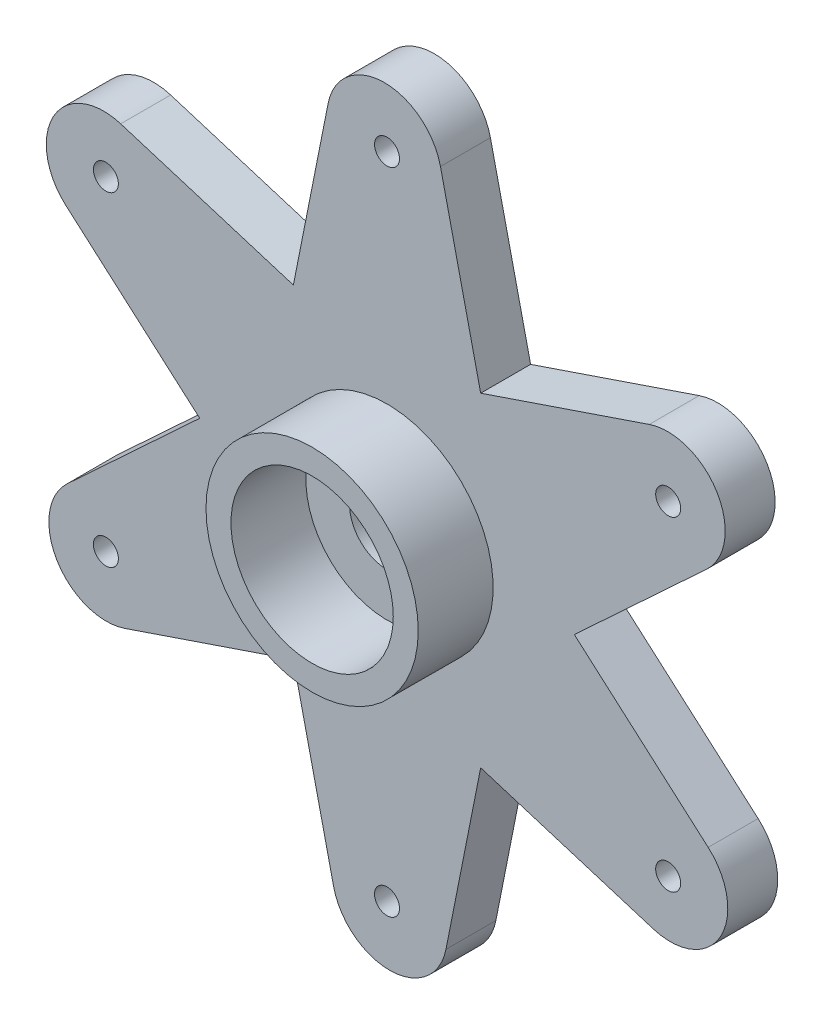
ISO-10303-21;
HEADER;
FILE_DESCRIPTION(('STEP AP214'),'2;1');
FILE_NAME('part.step','',(''),(''),'','','');
FILE_SCHEMA(('AUTOMOTIVE_DESIGN { 1 0 10303 214 1 1 1 1 }'));
ENDSEC;
DATA;
#1=APPLICATION_CONTEXT('core data for automotive mechanical design processes');
#2=APPLICATION_PROTOCOL_DEFINITION('international standard','automotive_design',2000,#1);
#3=PRODUCT_CONTEXT('',#1,'mechanical');
#4=PRODUCT('Part','Part','',(#3));
#5=PRODUCT_RELATED_PRODUCT_CATEGORY('part','',(#4));
#6=PRODUCT_DEFINITION_FORMATION('','',#4);
#7=PRODUCT_DEFINITION_CONTEXT('part definition',#1,'design');
#8=PRODUCT_DEFINITION('design','',#6,#7);
#9=PRODUCT_DEFINITION_SHAPE('','',#8);
#10=(LENGTH_UNIT() NAMED_UNIT(*) SI_UNIT(.MILLI.,.METRE.));
#11=(NAMED_UNIT(*) PLANE_ANGLE_UNIT() SI_UNIT($,.RADIAN.));
#12=(NAMED_UNIT(*) SI_UNIT($,.STERADIAN.) SOLID_ANGLE_UNIT());
#13=UNCERTAINTY_MEASURE_WITH_UNIT(LENGTH_MEASURE(1.E-05),#10,'distance_accuracy_value','');
#14=(GEOMETRIC_REPRESENTATION_CONTEXT(3) GLOBAL_UNCERTAINTY_ASSIGNED_CONTEXT((#13)) GLOBAL_UNIT_ASSIGNED_CONTEXT((#10,
#11,#12)) REPRESENTATION_CONTEXT('',''));
#15=CARTESIAN_POINT('',(0.,0.,0.));
#16=DIRECTION('',(0.,0.,1.));
#17=DIRECTION('',(1.,0.,0.));
#18=AXIS2_PLACEMENT_3D('',#15,#16,#17);
#19=CARTESIAN_POINT('',(11.2409388994982,6.60897085183293,1.));
#20=DIRECTION('',(0.,0.,-1.));
#21=DIRECTION('',(-1.,0.,0.));
#22=AXIS2_PLACEMENT_3D('',#19,#20,#21);
#23=PLANE('',#22);
#24=CARTESIAN_POINT('',(0.,0.,1.));
#25=DIRECTION('',(0.,0.,1.));
#26=DIRECTION('',(1.,0.,0.));
#27=AXIS2_PLACEMENT_3D('',#24,#25,#26);
#28=CIRCLE('',#27,1.5);
#29=CARTESIAN_POINT('',(1.5,0.,1.));
#30=VERTEX_POINT('',#29);
#31=EDGE_CURVE('E202',#30,#30,#28,.T.);
#32=ORIENTED_EDGE('',*,*,#31,.F.);
#33=EDGE_LOOP('',(#32));
#34=FACE_BOUND('',#33,.T.);
#35=CARTESIAN_POINT('',(0.,0.,1.));
#36=DIRECTION('',(0.,0.,1.));
#37=DIRECTION('',(1.,0.,0.));
#38=AXIS2_PLACEMENT_3D('',#35,#36,#37);
#39=CIRCLE('',#38,3.25);
#40=CARTESIAN_POINT('',(3.25,0.,1.));
#41=VERTEX_POINT('',#40);
#42=EDGE_CURVE('E713',#41,#41,#39,.T.);
#43=ORIENTED_EDGE('',*,*,#42,.T.);
#44=EDGE_LOOP('',(#43));
#45=FACE_BOUND('',#44,.T.);
#46=ADVANCED_FACE('F40',(#34,#45),#23,.F.);
#47=CARTESIAN_POINT('',(0.,13.,1.));
#48=DIRECTION('',(0.,0.,1.));
#49=DIRECTION('',(1.,0.,0.));
#50=AXIS2_PLACEMENT_3D('',#47,#48,#49);
#51=CIRCLE('',#50,0.5);
#52=CARTESIAN_POINT('',(0.5,13.,1.));
#53=VERTEX_POINT('',#52);
#54=EDGE_CURVE('E710',#53,#53,#51,.T.);
#55=ORIENTED_EDGE('',*,*,#54,.F.);
#56=EDGE_LOOP('',(#55));
#57=FACE_BOUND('',#56,.T.);
#58=CARTESIAN_POINT('',(11.258330249198,6.50000000000048,1.));
#59=DIRECTION('',(0.,0.,1.));
#60=DIRECTION('',(1.,0.,0.));
#61=AXIS2_PLACEMENT_3D('',#58,#59,#60);
#62=CIRCLE('',#61,0.500000000000155);
#63=CARTESIAN_POINT('',(11.7583302491981,6.50000000000048,1.));
#64=VERTEX_POINT('',#63);
#65=EDGE_CURVE('E719',#64,#64,#62,.T.);
#66=ORIENTED_EDGE('',*,*,#65,.F.);
#67=EDGE_LOOP('',(#66));
#68=FACE_BOUND('',#67,.T.);
#69=CARTESIAN_POINT('',(11.2583302491985,-6.49999999999952,1.));
#70=DIRECTION('',(0.,0.,1.));
#71=DIRECTION('',(1.,0.,0.));
#72=AXIS2_PLACEMENT_3D('',#69,#70,#71);
#73=CIRCLE('',#72,0.500000000000712);
#74=CARTESIAN_POINT('',(11.7583302491992,-6.49999999999952,1.));
#75=VERTEX_POINT('',#74);
#76=EDGE_CURVE('E740',#75,#75,#73,.T.);
#77=ORIENTED_EDGE('',*,*,#76,.F.);
#78=EDGE_LOOP('',(#77));
#79=FACE_BOUND('',#78,.T.);
#80=CARTESIAN_POINT('',(1.10367054526908E-12,-13.,1.));
#81=DIRECTION('',(0.,0.,1.));
#82=DIRECTION('',(1.,0.,0.));
#83=AXIS2_PLACEMENT_3D('',#80,#81,#82);
#84=CIRCLE('',#83,0.500000000001142);
#85=CARTESIAN_POINT('',(0.500000000002246,-13.,1.));
#86=VERTEX_POINT('',#85);
#87=EDGE_CURVE('E734',#86,#86,#84,.T.);
#88=ORIENTED_EDGE('',*,*,#87,.F.);
#89=EDGE_LOOP('',(#88));
#90=FACE_BOUND('',#89,.T.);
#91=CARTESIAN_POINT('',(-11.2583302491969,-6.50000000000048,1.));
#92=DIRECTION('',(0.,0.,1.));
#93=DIRECTION('',(1.,0.,0.));
#94=AXIS2_PLACEMENT_3D('',#91,#92,#93);
#95=CIRCLE('',#94,0.500000000001051);
#96=CARTESIAN_POINT('',(-10.7583302491958,-6.50000000000048,1.));
#97=VERTEX_POINT('',#96);
#98=EDGE_CURVE('E728',#97,#97,#95,.T.);
#99=ORIENTED_EDGE('',*,*,#98,.F.);
#100=EDGE_LOOP('',(#99));
#101=FACE_BOUND('',#100,.T.);
#102=CARTESIAN_POINT('',(-11.2583302491974,6.49999999999952,1.));
#103=DIRECTION('',(0.,0.,1.));
#104=DIRECTION('',(1.,0.,0.));
#105=AXIS2_PLACEMENT_3D('',#102,#103,#104);
#106=CIRCLE('',#105,0.500000000000557);
#107=CARTESIAN_POINT('',(-10.7583302491969,6.49999999999952,1.));
#108=VERTEX_POINT('',#107);
#109=EDGE_CURVE('E711',#108,#108,#106,.T.);
#110=ORIENTED_EDGE('',*,*,#109,.F.);
#111=EDGE_LOOP('',(#110));
#112=FACE_BOUND('',#111,.T.);
#113=CARTESIAN_POINT('',(0.,0.,1.));
#114=DIRECTION('',(0.,0.,-1.));
#115=DIRECTION('',(-1.,0.,0.));
#116=AXIS2_PLACEMENT_3D('',#113,#114,#115);
#117=CIRCLE('',#116,4.25);
#118=CARTESIAN_POINT('',(-4.25,0.,1.));
#119=VERTEX_POINT('',#118);
#120=EDGE_CURVE('E11',#119,#119,#117,.F.);
#121=ORIENTED_EDGE('',*,*,#120,.F.);
#122=EDGE_LOOP('',(#121));
#123=FACE_BOUND('',#122,.T.);
#124=DIRECTION('',(-0.946895822393242,-0.321540513052749,0.));
#125=VECTOR('',#124,1.);
#126=CARTESIAN_POINT('',(3.75,6.49519052838329,1.));
#127=LINE('',#126,#125);
#128=CARTESIAN_POINT('',(10.5011056178941,8.78768555551781,1.));
#129=VERTEX_POINT('',#128);
#130=CARTESIAN_POINT('',(3.75,6.49519052838329,1.));
#131=VERTEX_POINT('',#130);
#132=EDGE_CURVE('E233',#129,#131,#127,.T.);
#133=ORIENTED_EDGE('',*,*,#132,.T.);
#134=DIRECTION('',(-0.222430892223186,0.974948459245307,0.));
#135=VECTOR('',#134,1.);
#136=CARTESIAN_POINT('',(3.75,6.49519052838329,1.));
#137=LINE('',#136,#135);
#138=CARTESIAN_POINT('',(2.14019387739905,13.5512158098835,1.));
#139=VERTEX_POINT('',#138);
#140=EDGE_CURVE('E131',#131,#139,#137,.T.);
#141=ORIENTED_EDGE('',*,*,#140,.T.);
#142=CARTESIAN_POINT('',(-0.103067200809109,13.0394240752706,1.));
#143=DIRECTION('',(0.,0.,1.));
#144=DIRECTION('',(-1.,0.,0.));
#145=AXIS2_PLACEMENT_3D('',#142,#143,#144);
#146=CIRCLE('',#145,2.30090222404642);
#147=CARTESIAN_POINT('',(-2.35980612260095,13.4880670106787,1.));
#148=VERTEX_POINT('',#147);
#149=EDGE_CURVE('E297',#139,#148,#146,.T.);
#150=ORIENTED_EDGE('',*,*,#149,.T.);
#151=DIRECTION('',(-0.194985658547059,-0.98080609345628,0.));
#152=VECTOR('',#151,1.);
#153=CARTESIAN_POINT('',(-3.75,6.49519052838329,1.));
#154=LINE('',#153,#152);
#155=CARTESIAN_POINT('',(-3.75,6.49519052838329,1.));
#156=VERTEX_POINT('',#155);
#157=EDGE_CURVE('E294',#148,#156,#154,.T.);
#158=ORIENTED_EDGE('',*,*,#157,.T.);
#159=DIRECTION('',(-0.955545579198526,0.294843426370934,0.));
#160=VECTOR('',#159,1.);
#161=CARTESIAN_POINT('',(-3.75,6.49519052838329,1.));
#162=LINE('',#161,#160);
#163=CARTESIAN_POINT('',(-10.6656002048249,8.62907017179326,1.));
#164=VERTEX_POINT('',#163);
#165=EDGE_CURVE('E296',#156,#164,#162,.T.);
#166=ORIENTED_EDGE('',*,*,#165,.T.);
#167=CARTESIAN_POINT('',(-11.3440061003073,6.43045322343764,1.));
#168=DIRECTION('',(0.,0.,1.));
#169=DIRECTION('',(-1.,0.,0.));
#170=AXIS2_PLACEMENT_3D('',#167,#168,#169);
#171=CIRCLE('',#170,2.30090222404642);
#172=CARTESIAN_POINT('',(-12.860911740495,4.70038145516084,1.));
#173=VERTEX_POINT('',#172);
#174=EDGE_CURVE('E299',#164,#173,#171,.T.);
#175=ORIENTED_EDGE('',*,*,#174,.T.);
#176=DIRECTION('',(0.751910163846184,-0.659265580403531,0.));
#177=VECTOR('',#176,1.);
#178=CARTESIAN_POINT('',(-7.5,0.,1.));
#179=LINE('',#178,#177);
#180=CARTESIAN_POINT('',(-7.5,0.,1.));
#181=VERTEX_POINT('',#180);
#182=EDGE_CURVE('E305',#173,#181,#179,.T.);
#183=ORIENTED_EDGE('',*,*,#182,.T.);
#184=DIRECTION('',(-0.73311468697534,-0.680105032874371,0.));
#185=VECTOR('',#184,1.);
#186=CARTESIAN_POINT('',(-7.5,0.,1.));
#187=LINE('',#186,#185);
#188=CARTESIAN_POINT('',(-12.805794082224,-4.92214563809028,1.));
#189=VERTEX_POINT('',#188);
#190=EDGE_CURVE('E307',#181,#189,#187,.T.);
#191=ORIENTED_EDGE('',*,*,#190,.T.);
#192=CARTESIAN_POINT('',(-11.2409388994982,-6.60897085183294,1.));
#193=DIRECTION('',(0.,0.,1.));
#194=DIRECTION('',(-1.,0.,0.));
#195=AXIS2_PLACEMENT_3D('',#192,#193,#194);
#196=CIRCLE('',#195,2.30090222404643);
#197=CARTESIAN_POINT('',(-10.5011056178941,-8.78768555551782,1.));
#198=VERTEX_POINT('',#197);
#199=EDGE_CURVE('E309',#189,#198,#196,.T.);
#200=ORIENTED_EDGE('',*,*,#199,.T.);
#201=DIRECTION('',(0.946895822393242,0.32154051305275,0.));
#202=VECTOR('',#201,1.);
#203=CARTESIAN_POINT('',(-3.75,-6.4951905283833,1.));
#204=LINE('',#203,#202);
#205=CARTESIAN_POINT('',(-3.75,-6.4951905283833,1.));
#206=VERTEX_POINT('',#205);
#207=EDGE_CURVE('E311',#198,#206,#204,.T.);
#208=ORIENTED_EDGE('',*,*,#207,.T.);
#209=DIRECTION('',(0.222430892223186,-0.974948459245307,0.));
#210=VECTOR('',#209,1.);
#211=CARTESIAN_POINT('',(-3.75,-6.4951905283833,1.));
#212=LINE('',#211,#210);
#213=CARTESIAN_POINT('',(-2.14019387739905,-13.5512158098835,1.));
#214=VERTEX_POINT('',#213);
#215=EDGE_CURVE('E313',#206,#214,#212,.T.);
#216=ORIENTED_EDGE('',*,*,#215,.T.);
#217=CARTESIAN_POINT('',(0.103067200809111,-13.0394240752706,1.));
#218=DIRECTION('',(0.,0.,1.));
#219=DIRECTION('',(-1.,0.,0.));
#220=AXIS2_PLACEMENT_3D('',#217,#218,#219);
#221=CIRCLE('',#220,2.30090222404642);
#222=CARTESIAN_POINT('',(2.35980612260095,-13.4880670106787,1.));
#223=VERTEX_POINT('',#222);
#224=EDGE_CURVE('E315',#214,#223,#221,.T.);
#225=ORIENTED_EDGE('',*,*,#224,.T.);
#226=DIRECTION('',(0.194985658547059,0.98080609345628,0.));
#227=VECTOR('',#226,1.);
#228=CARTESIAN_POINT('',(3.75,-6.4951905283833,1.));
#229=LINE('',#228,#227);
#230=CARTESIAN_POINT('',(3.75,-6.4951905283833,1.));
#231=VERTEX_POINT('',#230);
#232=EDGE_CURVE('E317',#223,#231,#229,.T.);
#233=ORIENTED_EDGE('',*,*,#232,.T.);
#234=DIRECTION('',(0.955545579198526,-0.294843426370935,0.));
#235=VECTOR('',#234,1.);
#236=CARTESIAN_POINT('',(3.75,-6.4951905283833,1.));
#237=LINE('',#236,#235);
#238=CARTESIAN_POINT('',(10.6656002048249,-8.62907017179327,1.));
#239=VERTEX_POINT('',#238);
#240=EDGE_CURVE('E319',#231,#239,#237,.T.);
#241=ORIENTED_EDGE('',*,*,#240,.T.);
#242=CARTESIAN_POINT('',(11.3440061003073,-6.43045322343765,1.));
#243=DIRECTION('',(0.,0.,1.));
#244=DIRECTION('',(-1.,0.,0.));
#245=AXIS2_PLACEMENT_3D('',#242,#243,#244);
#246=CIRCLE('',#245,2.30090222404642);
#247=CARTESIAN_POINT('',(12.860911740495,-4.70038145516085,1.));
#248=VERTEX_POINT('',#247);
#249=EDGE_CURVE('E180',#239,#248,#246,.T.);
#250=ORIENTED_EDGE('',*,*,#249,.T.);
#251=DIRECTION('',(-0.751910163846184,0.659265580403531,0.));
#252=VECTOR('',#251,1.);
#253=CARTESIAN_POINT('',(7.5,0.,1.));
#254=LINE('',#253,#252);
#255=CARTESIAN_POINT('',(7.5,0.,1.));
#256=VERTEX_POINT('',#255);
#257=EDGE_CURVE('E174',#248,#256,#254,.T.);
#258=ORIENTED_EDGE('',*,*,#257,.T.);
#259=DIRECTION('',(0.73311468697534,0.680105032874371,0.));
#260=VECTOR('',#259,1.);
#261=CARTESIAN_POINT('',(7.5,0.,1.));
#262=LINE('',#261,#260);
#263=CARTESIAN_POINT('',(12.805794082224,4.92214563809027,1.));
#264=VERTEX_POINT('',#263);
#265=EDGE_CURVE('E178',#256,#264,#262,.T.);
#266=ORIENTED_EDGE('',*,*,#265,.T.);
#267=CARTESIAN_POINT('',(11.2409388994982,6.60897085183293,1.));
#268=DIRECTION('',(0.,0.,1.));
#269=DIRECTION('',(-1.,0.,0.));
#270=AXIS2_PLACEMENT_3D('',#267,#268,#269);
#271=CIRCLE('',#270,2.30090222404642);
#272=EDGE_CURVE('E57',#264,#129,#271,.T.);
#273=ORIENTED_EDGE('',*,*,#272,.T.);
#274=EDGE_LOOP('',(#133,#141,#150,#158,#166,#175,#183,#191,#200,#208,#216,#225,#233,#241,#250,
#258,#266,#273));
#275=FACE_BOUND('',#274,.T.);
#276=ADVANCED_FACE('F176',(#57,#68,#79,#90,#101,#112,#123,#275),#23,.F.);
#277=CARTESIAN_POINT('',(11.2409388994982,6.60897085183293,-1.));
#278=DIRECTION('',(0.,0.,-1.));
#279=DIRECTION('',(-1.,0.,0.));
#280=AXIS2_PLACEMENT_3D('',#277,#278,#279);
#281=PLANE('',#280);
#282=CARTESIAN_POINT('',(0.,13.,-1.));
#283=DIRECTION('',(0.,0.,1.));
#284=DIRECTION('',(1.,0.,0.));
#285=AXIS2_PLACEMENT_3D('',#282,#283,#284);
#286=CIRCLE('',#285,0.5);
#287=CARTESIAN_POINT('',(0.5,13.,-1.));
#288=VERTEX_POINT('',#287);
#289=EDGE_CURVE('E707',#288,#288,#286,.T.);
#290=ORIENTED_EDGE('',*,*,#289,.T.);
#291=EDGE_LOOP('',(#290));
#292=FACE_BOUND('',#291,.T.);
#293=CARTESIAN_POINT('',(11.258330249198,6.50000000000048,-1.));
#294=DIRECTION('',(0.,0.,1.));
#295=DIRECTION('',(1.,0.,0.));
#296=AXIS2_PLACEMENT_3D('',#293,#294,#295);
#297=CIRCLE('',#296,0.500000000000155);
#298=CARTESIAN_POINT('',(11.7583302491981,6.50000000000048,-1.));
#299=VERTEX_POINT('',#298);
#300=EDGE_CURVE('E723',#299,#299,#297,.T.);
#301=ORIENTED_EDGE('',*,*,#300,.T.);
#302=EDGE_LOOP('',(#301));
#303=FACE_BOUND('',#302,.T.);
#304=CARTESIAN_POINT('',(11.2583302491985,-6.49999999999952,-1.));
#305=DIRECTION('',(0.,0.,1.));
#306=DIRECTION('',(1.,0.,0.));
#307=AXIS2_PLACEMENT_3D('',#304,#305,#306);
#308=CIRCLE('',#307,0.500000000000712);
#309=CARTESIAN_POINT('',(11.7583302491992,-6.49999999999952,-1.));
#310=VERTEX_POINT('',#309);
#311=EDGE_CURVE('E722',#310,#310,#308,.T.);
#312=ORIENTED_EDGE('',*,*,#311,.T.);
#313=EDGE_LOOP('',(#312));
#314=FACE_BOUND('',#313,.T.);
#315=CARTESIAN_POINT('',(1.10367054526908E-12,-13.,-1.));
#316=DIRECTION('',(0.,0.,1.));
#317=DIRECTION('',(1.,0.,0.));
#318=AXIS2_PLACEMENT_3D('',#315,#316,#317);
#319=CIRCLE('',#318,0.500000000001142);
#320=CARTESIAN_POINT('',(0.500000000002246,-13.,-1.));
#321=VERTEX_POINT('',#320);
#322=EDGE_CURVE('E737',#321,#321,#319,.T.);
#323=ORIENTED_EDGE('',*,*,#322,.T.);
#324=EDGE_LOOP('',(#323));
#325=FACE_BOUND('',#324,.T.);
#326=CARTESIAN_POINT('',(-11.2583302491969,-6.50000000000048,-1.));
#327=DIRECTION('',(0.,0.,1.));
#328=DIRECTION('',(1.,0.,0.));
#329=AXIS2_PLACEMENT_3D('',#326,#327,#328);
#330=CIRCLE('',#329,0.500000000001051);
#331=CARTESIAN_POINT('',(-10.7583302491958,-6.50000000000048,-1.));
#332=VERTEX_POINT('',#331);
#333=EDGE_CURVE('E731',#332,#332,#330,.T.);
#334=ORIENTED_EDGE('',*,*,#333,.T.);
#335=EDGE_LOOP('',(#334));
#336=FACE_BOUND('',#335,.T.);
#337=CARTESIAN_POINT('',(-11.2583302491974,6.49999999999952,-1.));
#338=DIRECTION('',(0.,0.,1.));
#339=DIRECTION('',(1.,0.,0.));
#340=AXIS2_PLACEMENT_3D('',#337,#338,#339);
#341=CIRCLE('',#340,0.500000000000557);
#342=CARTESIAN_POINT('',(-10.7583302491969,6.49999999999952,-1.));
#343=VERTEX_POINT('',#342);
#344=EDGE_CURVE('E716',#343,#343,#341,.T.);
#345=ORIENTED_EDGE('',*,*,#344,.T.);
#346=EDGE_LOOP('',(#345));
#347=FACE_BOUND('',#346,.T.);
#348=DIRECTION('',(-0.946895822393242,-0.321540513052749,0.));
#349=VECTOR('',#348,1.);
#350=CARTESIAN_POINT('',(3.75,6.49519052838329,-1.));
#351=LINE('',#350,#349);
#352=CARTESIAN_POINT('',(10.5011056178941,8.78768555551781,-1.));
#353=VERTEX_POINT('',#352);
#354=CARTESIAN_POINT('',(3.75,6.49519052838329,-1.));
#355=VERTEX_POINT('',#354);
#356=EDGE_CURVE('E198',#353,#355,#351,.T.);
#357=ORIENTED_EDGE('',*,*,#356,.F.);
#358=CARTESIAN_POINT('',(11.2409388994982,6.60897085183293,-1.));
#359=DIRECTION('',(0.,0.,1.));
#360=DIRECTION('',(-1.,0.,0.));
#361=AXIS2_PLACEMENT_3D('',#358,#359,#360);
#362=CIRCLE('',#361,2.30090222404642);
#363=CARTESIAN_POINT('',(12.805794082224,4.92214563809027,-1.));
#364=VERTEX_POINT('',#363);
#365=EDGE_CURVE('E122',#364,#353,#362,.T.);
#366=ORIENTED_EDGE('',*,*,#365,.F.);
#367=DIRECTION('',(0.73311468697534,0.680105032874371,0.));
#368=VECTOR('',#367,1.);
#369=CARTESIAN_POINT('',(7.5,0.,-1.));
#370=LINE('',#369,#368);
#371=CARTESIAN_POINT('',(7.5,0.,-1.));
#372=VERTEX_POINT('',#371);
#373=EDGE_CURVE('E116',#372,#364,#370,.T.);
#374=ORIENTED_EDGE('',*,*,#373,.F.);
#375=DIRECTION('',(-0.751910163846184,0.659265580403531,0.));
#376=VECTOR('',#375,1.);
#377=CARTESIAN_POINT('',(7.5,0.,-1.));
#378=LINE('',#377,#376);
#379=CARTESIAN_POINT('',(12.860911740495,-4.70038145516085,-1.));
#380=VERTEX_POINT('',#379);
#381=EDGE_CURVE('E188',#380,#372,#378,.T.);
#382=ORIENTED_EDGE('',*,*,#381,.F.);
#383=CARTESIAN_POINT('',(11.3440061003073,-6.43045322343765,-1.));
#384=DIRECTION('',(0.,0.,1.));
#385=DIRECTION('',(-1.,0.,0.));
#386=AXIS2_PLACEMENT_3D('',#383,#384,#385);
#387=CIRCLE('',#386,2.30090222404642);
#388=CARTESIAN_POINT('',(10.6656002048249,-8.62907017179327,-1.));
#389=VERTEX_POINT('',#388);
#390=EDGE_CURVE('E228',#389,#380,#387,.T.);
#391=ORIENTED_EDGE('',*,*,#390,.F.);
#392=DIRECTION('',(0.955545579198526,-0.294843426370935,0.));
#393=VECTOR('',#392,1.);
#394=CARTESIAN_POINT('',(3.75,-6.4951905283833,-1.));
#395=LINE('',#394,#393);
#396=CARTESIAN_POINT('',(3.75,-6.4951905283833,-1.));
#397=VERTEX_POINT('',#396);
#398=EDGE_CURVE('E226',#397,#389,#395,.T.);
#399=ORIENTED_EDGE('',*,*,#398,.F.);
#400=DIRECTION('',(0.194985658547059,0.98080609345628,0.));
#401=VECTOR('',#400,1.);
#402=CARTESIAN_POINT('',(3.75,-6.4951905283833,-1.));
#403=LINE('',#402,#401);
#404=CARTESIAN_POINT('',(2.35980612260095,-13.4880670106787,-1.));
#405=VERTEX_POINT('',#404);
#406=EDGE_CURVE('E224',#405,#397,#403,.T.);
#407=ORIENTED_EDGE('',*,*,#406,.F.);
#408=CARTESIAN_POINT('',(0.103067200809111,-13.0394240752706,-1.));
#409=DIRECTION('',(0.,0.,1.));
#410=DIRECTION('',(-1.,0.,0.));
#411=AXIS2_PLACEMENT_3D('',#408,#409,#410);
#412=CIRCLE('',#411,2.30090222404642);
#413=CARTESIAN_POINT('',(-2.14019387739905,-13.5512158098835,-1.));
#414=VERTEX_POINT('',#413);
#415=EDGE_CURVE('E222',#414,#405,#412,.T.);
#416=ORIENTED_EDGE('',*,*,#415,.F.);
#417=DIRECTION('',(0.222430892223186,-0.974948459245307,0.));
#418=VECTOR('',#417,1.);
#419=CARTESIAN_POINT('',(-3.75,-6.4951905283833,-1.));
#420=LINE('',#419,#418);
#421=CARTESIAN_POINT('',(-3.75,-6.4951905283833,-1.));
#422=VERTEX_POINT('',#421);
#423=EDGE_CURVE('E220',#422,#414,#420,.T.);
#424=ORIENTED_EDGE('',*,*,#423,.F.);
#425=DIRECTION('',(0.946895822393242,0.32154051305275,0.));
#426=VECTOR('',#425,1.);
#427=CARTESIAN_POINT('',(-3.75,-6.4951905283833,-1.));
#428=LINE('',#427,#426);
#429=CARTESIAN_POINT('',(-10.5011056178941,-8.78768555551782,-1.));
#430=VERTEX_POINT('',#429);
#431=EDGE_CURVE('E218',#430,#422,#428,.T.);
#432=ORIENTED_EDGE('',*,*,#431,.F.);
#433=CARTESIAN_POINT('',(-11.2409388994982,-6.60897085183294,-1.));
#434=DIRECTION('',(0.,0.,1.));
#435=DIRECTION('',(-1.,0.,0.));
#436=AXIS2_PLACEMENT_3D('',#433,#434,#435);
#437=CIRCLE('',#436,2.30090222404643);
#438=CARTESIAN_POINT('',(-12.805794082224,-4.92214563809028,-1.));
#439=VERTEX_POINT('',#438);
#440=EDGE_CURVE('E216',#439,#430,#437,.T.);
#441=ORIENTED_EDGE('',*,*,#440,.F.);
#442=DIRECTION('',(-0.73311468697534,-0.680105032874371,0.));
#443=VECTOR('',#442,1.);
#444=CARTESIAN_POINT('',(-7.5,0.,-1.));
#445=LINE('',#444,#443);
#446=CARTESIAN_POINT('',(-7.5,0.,-1.));
#447=VERTEX_POINT('',#446);
#448=EDGE_CURVE('E214',#447,#439,#445,.T.);
#449=ORIENTED_EDGE('',*,*,#448,.F.);
#450=DIRECTION('',(0.751910163846184,-0.659265580403531,0.));
#451=VECTOR('',#450,1.);
#452=CARTESIAN_POINT('',(-7.5,0.,-1.));
#453=LINE('',#452,#451);
#454=CARTESIAN_POINT('',(-12.860911740495,4.70038145516084,-1.));
#455=VERTEX_POINT('',#454);
#456=EDGE_CURVE('E212',#455,#447,#453,.T.);
#457=ORIENTED_EDGE('',*,*,#456,.F.);
#458=CARTESIAN_POINT('',(-11.3440061003073,6.43045322343764,-1.));
#459=DIRECTION('',(0.,0.,1.));
#460=DIRECTION('',(-1.,0.,0.));
#461=AXIS2_PLACEMENT_3D('',#458,#459,#460);
#462=CIRCLE('',#461,2.30090222404642);
#463=CARTESIAN_POINT('',(-10.6656002048249,8.62907017179326,-1.));
#464=VERTEX_POINT('',#463);
#465=EDGE_CURVE('E210',#464,#455,#462,.T.);
#466=ORIENTED_EDGE('',*,*,#465,.F.);
#467=DIRECTION('',(-0.955545579198526,0.294843426370934,0.));
#468=VECTOR('',#467,1.);
#469=CARTESIAN_POINT('',(-3.75,6.49519052838329,-1.));
#470=LINE('',#469,#468);
#471=CARTESIAN_POINT('',(-3.75,6.49519052838329,-1.));
#472=VERTEX_POINT('',#471);
#473=EDGE_CURVE('E208',#472,#464,#470,.T.);
#474=ORIENTED_EDGE('',*,*,#473,.F.);
#475=DIRECTION('',(-0.194985658547059,-0.98080609345628,0.));
#476=VECTOR('',#475,1.);
#477=CARTESIAN_POINT('',(-3.75,6.49519052838329,-1.));
#478=LINE('',#477,#476);
#479=CARTESIAN_POINT('',(-2.35980612260095,13.4880670106787,-1.));
#480=VERTEX_POINT('',#479);
#481=EDGE_CURVE('E206',#480,#472,#478,.T.);
#482=ORIENTED_EDGE('',*,*,#481,.F.);
#483=CARTESIAN_POINT('',(-0.103067200809109,13.0394240752706,-1.));
#484=DIRECTION('',(0.,0.,1.));
#485=DIRECTION('',(-1.,0.,0.));
#486=AXIS2_PLACEMENT_3D('',#483,#484,#485);
#487=CIRCLE('',#486,2.30090222404642);
#488=CARTESIAN_POINT('',(2.14019387739905,13.5512158098835,-1.));
#489=VERTEX_POINT('',#488);
#490=EDGE_CURVE('E204',#489,#480,#487,.T.);
#491=ORIENTED_EDGE('',*,*,#490,.F.);
#492=DIRECTION('',(-0.222430892223186,0.974948459245307,0.));
#493=VECTOR('',#492,1.);
#494=CARTESIAN_POINT('',(3.75,6.49519052838329,-1.));
#495=LINE('',#494,#493);
#496=EDGE_CURVE('E201',#355,#489,#495,.T.);
#497=ORIENTED_EDGE('',*,*,#496,.F.);
#498=EDGE_LOOP('',(#357,#366,#374,#382,#391,#399,#407,#416,#424,#432,#441,#449,#457,#466,#474,
#482,#491,#497));
#499=FACE_BOUND('',#498,.T.);
#500=CARTESIAN_POINT('',(0.,0.,-1.));
#501=DIRECTION('',(0.,0.,1.));
#502=DIRECTION('',(1.,0.,0.));
#503=AXIS2_PLACEMENT_3D('',#500,#501,#502);
#504=CIRCLE('',#503,1.5);
#505=CARTESIAN_POINT('',(1.5,0.,-1.));
#506=VERTEX_POINT('',#505);
#507=EDGE_CURVE('E753',#506,#506,#504,.T.);
#508=ORIENTED_EDGE('',*,*,#507,.T.);
#509=EDGE_LOOP('',(#508));
#510=FACE_BOUND('',#509,.T.);
#511=ADVANCED_FACE('F281',(#292,#303,#314,#325,#336,#347,#499,#510),#281,.T.);
#512=CARTESIAN_POINT('',(3.75,6.49519052838329,1.));
#513=DIRECTION('',(0.321540513052749,-0.946895822393243,0.));
#514=DIRECTION('',(0.946895822393243,0.321540513052749,0.));
#515=AXIS2_PLACEMENT_3D('',#512,#513,#514);
#516=PLANE('',#515);
#517=ORIENTED_EDGE('',*,*,#356,.T.);
#518=DIRECTION('',(0.,0.,-1.));
#519=VECTOR('',#518,1.);
#520=CARTESIAN_POINT('',(3.75,6.49519052838329,1.));
#521=LINE('',#520,#519);
#522=EDGE_CURVE('E49',#131,#355,#521,.T.);
#523=ORIENTED_EDGE('',*,*,#522,.F.);
#524=ORIENTED_EDGE('',*,*,#132,.F.);
#525=DIRECTION('',(0.,0.,-1.));
#526=VECTOR('',#525,1.);
#527=CARTESIAN_POINT('',(10.5011056178941,8.78768555551781,1.));
#528=LINE('',#527,#526);
#529=EDGE_CURVE('E194',#129,#353,#528,.T.);
#530=ORIENTED_EDGE('',*,*,#529,.T.);
#531=EDGE_LOOP('',(#517,#523,#524,#530));
#532=FACE_BOUND('',#531,.T.);
#533=ADVANCED_FACE('F42',(#532),#516,.F.);
#534=CARTESIAN_POINT('',(3.75,6.49519052838329,1.));
#535=DIRECTION('',(-0.974948459245307,-0.222430892223186,0.));
#536=DIRECTION('',(0.222430892223186,-0.974948459245307,0.));
#537=AXIS2_PLACEMENT_3D('',#534,#535,#536);
#538=PLANE('',#537);
#539=ORIENTED_EDGE('',*,*,#496,.T.);
#540=DIRECTION('',(0.,0.,-1.));
#541=VECTOR('',#540,1.);
#542=CARTESIAN_POINT('',(2.14019387739905,13.5512158098835,1.));
#543=LINE('',#542,#541);
#544=EDGE_CURVE('E273',#139,#489,#543,.T.);
#545=ORIENTED_EDGE('',*,*,#544,.F.);
#546=ORIENTED_EDGE('',*,*,#140,.F.);
#547=ORIENTED_EDGE('',*,*,#522,.T.);
#548=EDGE_LOOP('',(#539,#545,#546,#547));
#549=FACE_BOUND('',#548,.T.);
#550=ADVANCED_FACE('F276',(#549),#538,.F.);
#551=CARTESIAN_POINT('',(-0.103067200809109,13.0394240752706,1.));
#552=DIRECTION('',(0.,0.,-1.));
#553=DIRECTION('',(-1.,0.,0.));
#554=AXIS2_PLACEMENT_3D('',#551,#552,#553);
#555=CYLINDRICAL_SURFACE('',#554,2.30090222404642);
#556=ORIENTED_EDGE('',*,*,#490,.T.);
#557=DIRECTION('',(0.,0.,-1.));
#558=VECTOR('',#557,1.);
#559=CARTESIAN_POINT('',(-2.35980612260095,13.4880670106787,1.));
#560=LINE('',#559,#558);
#561=EDGE_CURVE('E270',#148,#480,#560,.T.);
#562=ORIENTED_EDGE('',*,*,#561,.F.);
#563=ORIENTED_EDGE('',*,*,#149,.F.);
#564=ORIENTED_EDGE('',*,*,#544,.T.);
#565=EDGE_LOOP('',(#556,#562,#563,#564));
#566=FACE_BOUND('',#565,.T.);
#567=ADVANCED_FACE('F288',(#566),#555,.T.);
#568=CARTESIAN_POINT('',(-3.75,6.49519052838329,1.));
#569=DIRECTION('',(0.980806093456281,-0.194985658547059,0.));
#570=DIRECTION('',(0.194985658547059,0.980806093456281,0.));
#571=AXIS2_PLACEMENT_3D('',#568,#569,#570);
#572=PLANE('',#571);
#573=ORIENTED_EDGE('',*,*,#481,.T.);
#574=DIRECTION('',(0.,0.,-1.));
#575=VECTOR('',#574,1.);
#576=CARTESIAN_POINT('',(-3.75,6.49519052838329,1.));
#577=LINE('',#576,#575);
#578=EDGE_CURVE('E267',#156,#472,#577,.T.);
#579=ORIENTED_EDGE('',*,*,#578,.F.);
#580=ORIENTED_EDGE('',*,*,#157,.F.);
#581=ORIENTED_EDGE('',*,*,#561,.T.);
#582=EDGE_LOOP('',(#573,#579,#580,#581));
#583=FACE_BOUND('',#582,.T.);
#584=ADVANCED_FACE('F292',(#583),#572,.F.);
#585=CARTESIAN_POINT('',(-3.75,6.49519052838329,1.));
#586=DIRECTION('',(-0.294843426370934,-0.955545579198527,0.));
#587=DIRECTION('',(0.955545579198527,-0.294843426370934,0.));
#588=AXIS2_PLACEMENT_3D('',#585,#586,#587);
#589=PLANE('',#588);
#590=ORIENTED_EDGE('',*,*,#473,.T.);
#591=DIRECTION('',(0.,0.,-1.));
#592=VECTOR('',#591,1.);
#593=CARTESIAN_POINT('',(-10.6656002048249,8.62907017179326,1.));
#594=LINE('',#593,#592);
#595=EDGE_CURVE('E264',#164,#464,#594,.T.);
#596=ORIENTED_EDGE('',*,*,#595,.F.);
#597=ORIENTED_EDGE('',*,*,#165,.F.);
#598=ORIENTED_EDGE('',*,*,#578,.T.);
#599=EDGE_LOOP('',(#590,#596,#597,#598));
#600=FACE_BOUND('',#599,.T.);
#601=ADVANCED_FACE('F370',(#600),#589,.F.);
#602=CARTESIAN_POINT('',(-11.3440061003073,6.43045322343764,1.));
#603=DIRECTION('',(0.,0.,-1.));
#604=DIRECTION('',(-1.,0.,0.));
#605=AXIS2_PLACEMENT_3D('',#602,#603,#604);
#606=CYLINDRICAL_SURFACE('',#605,2.30090222404642);
#607=ORIENTED_EDGE('',*,*,#465,.T.);
#608=DIRECTION('',(0.,0.,-1.));
#609=VECTOR('',#608,1.);
#610=CARTESIAN_POINT('',(-12.860911740495,4.70038145516084,1.));
#611=LINE('',#610,#609);
#612=EDGE_CURVE('E261',#173,#455,#611,.T.);
#613=ORIENTED_EDGE('',*,*,#612,.F.);
#614=ORIENTED_EDGE('',*,*,#174,.F.);
#615=ORIENTED_EDGE('',*,*,#595,.T.);
#616=EDGE_LOOP('',(#607,#613,#614,#615));
#617=FACE_BOUND('',#616,.T.);
#618=ADVANCED_FACE('F367',(#617),#606,.T.);
#619=CARTESIAN_POINT('',(-7.5,0.,1.));
#620=DIRECTION('',(0.659265580403531,0.751910163846184,0.));
#621=DIRECTION('',(-0.751910163846184,0.659265580403531,0.));
#622=AXIS2_PLACEMENT_3D('',#619,#620,#621);
#623=PLANE('',#622);
#624=ORIENTED_EDGE('',*,*,#456,.T.);
#625=DIRECTION('',(0.,0.,-1.));
#626=VECTOR('',#625,1.);
#627=CARTESIAN_POINT('',(-7.5,0.,1.));
#628=LINE('',#627,#626);
#629=EDGE_CURVE('E258',#181,#447,#628,.T.);
#630=ORIENTED_EDGE('',*,*,#629,.F.);
#631=ORIENTED_EDGE('',*,*,#182,.F.);
#632=ORIENTED_EDGE('',*,*,#612,.T.);
#633=EDGE_LOOP('',(#624,#630,#631,#632));
#634=FACE_BOUND('',#633,.T.);
#635=ADVANCED_FACE('F362',(#634),#623,.F.);
#636=CARTESIAN_POINT('',(-7.5,0.,1.));
#637=DIRECTION('',(0.680105032874371,-0.73311468697534,0.));
#638=DIRECTION('',(0.73311468697534,0.680105032874371,0.));
#639=AXIS2_PLACEMENT_3D('',#636,#637,#638);
#640=PLANE('',#639);
#641=ORIENTED_EDGE('',*,*,#448,.T.);
#642=DIRECTION('',(0.,0.,-1.));
#643=VECTOR('',#642,1.);
#644=CARTESIAN_POINT('',(-12.805794082224,-4.92214563809028,1.));
#645=LINE('',#644,#643);
#646=EDGE_CURVE('E255',#189,#439,#645,.T.);
#647=ORIENTED_EDGE('',*,*,#646,.F.);
#648=ORIENTED_EDGE('',*,*,#190,.F.);
#649=ORIENTED_EDGE('',*,*,#629,.T.);
#650=EDGE_LOOP('',(#641,#647,#648,#649));
#651=FACE_BOUND('',#650,.T.);
#652=ADVANCED_FACE('F357',(#651),#640,.F.);
#653=CARTESIAN_POINT('',(-11.2409388994982,-6.60897085183294,1.));
#654=DIRECTION('',(0.,0.,-1.));
#655=DIRECTION('',(-1.,0.,0.));
#656=AXIS2_PLACEMENT_3D('',#653,#654,#655);
#657=CYLINDRICAL_SURFACE('',#656,2.30090222404643);
#658=ORIENTED_EDGE('',*,*,#440,.T.);
#659=DIRECTION('',(0.,0.,-1.));
#660=VECTOR('',#659,1.);
#661=CARTESIAN_POINT('',(-10.5011056178941,-8.78768555551782,1.));
#662=LINE('',#661,#660);
#663=EDGE_CURVE('E252',#198,#430,#662,.T.);
#664=ORIENTED_EDGE('',*,*,#663,.F.);
#665=ORIENTED_EDGE('',*,*,#199,.F.);
#666=ORIENTED_EDGE('',*,*,#646,.T.);
#667=EDGE_LOOP('',(#658,#664,#665,#666));
#668=FACE_BOUND('',#667,.T.);
#669=ADVANCED_FACE('F353',(#668),#657,.T.);
#670=CARTESIAN_POINT('',(-3.75,-6.4951905283833,1.));
#671=DIRECTION('',(-0.32154051305275,0.946895822393242,0.));
#672=DIRECTION('',(-0.946895822393242,-0.32154051305275,0.));
#673=AXIS2_PLACEMENT_3D('',#670,#671,#672);
#674=PLANE('',#673);
#675=ORIENTED_EDGE('',*,*,#431,.T.);
#676=DIRECTION('',(0.,0.,-1.));
#677=VECTOR('',#676,1.);
#678=CARTESIAN_POINT('',(-3.75,-6.4951905283833,1.));
#679=LINE('',#678,#677);
#680=EDGE_CURVE('E249',#206,#422,#679,.T.);
#681=ORIENTED_EDGE('',*,*,#680,.F.);
#682=ORIENTED_EDGE('',*,*,#207,.F.);
#683=ORIENTED_EDGE('',*,*,#663,.T.);
#684=EDGE_LOOP('',(#675,#681,#682,#683));
#685=FACE_BOUND('',#684,.T.);
#686=ADVANCED_FACE('F348',(#685),#674,.F.);
#687=CARTESIAN_POINT('',(-3.75,-6.4951905283833,1.));
#688=DIRECTION('',(0.974948459245307,0.222430892223186,0.));
#689=DIRECTION('',(-0.222430892223186,0.974948459245307,0.));
#690=AXIS2_PLACEMENT_3D('',#687,#688,#689);
#691=PLANE('',#690);
#692=ORIENTED_EDGE('',*,*,#423,.T.);
#693=DIRECTION('',(0.,0.,-1.));
#694=VECTOR('',#693,1.);
#695=CARTESIAN_POINT('',(-2.14019387739905,-13.5512158098835,1.));
#696=LINE('',#695,#694);
#697=EDGE_CURVE('E246',#214,#414,#696,.T.);
#698=ORIENTED_EDGE('',*,*,#697,.F.);
#699=ORIENTED_EDGE('',*,*,#215,.F.);
#700=ORIENTED_EDGE('',*,*,#680,.T.);
#701=EDGE_LOOP('',(#692,#698,#699,#700));
#702=FACE_BOUND('',#701,.T.);
#703=ADVANCED_FACE('F342',(#702),#691,.F.);
#704=CARTESIAN_POINT('',(0.103067200809111,-13.0394240752706,1.));
#705=DIRECTION('',(0.,0.,-1.));
#706=DIRECTION('',(-1.,0.,0.));
#707=AXIS2_PLACEMENT_3D('',#704,#705,#706);
#708=CYLINDRICAL_SURFACE('',#707,2.30090222404642);
#709=ORIENTED_EDGE('',*,*,#415,.T.);
#710=DIRECTION('',(0.,0.,-1.));
#711=VECTOR('',#710,1.);
#712=CARTESIAN_POINT('',(2.35980612260095,-13.4880670106787,1.));
#713=LINE('',#712,#711);
#714=EDGE_CURVE('E243',#223,#405,#713,.T.);
#715=ORIENTED_EDGE('',*,*,#714,.F.);
#716=ORIENTED_EDGE('',*,*,#224,.F.);
#717=ORIENTED_EDGE('',*,*,#697,.T.);
#718=EDGE_LOOP('',(#709,#715,#716,#717));
#719=FACE_BOUND('',#718,.T.);
#720=ADVANCED_FACE('F338',(#719),#708,.T.);
#721=CARTESIAN_POINT('',(3.75,-6.4951905283833,1.));
#722=DIRECTION('',(-0.980806093456281,0.194985658547059,0.));
#723=DIRECTION('',(-0.194985658547059,-0.980806093456281,0.));
#724=AXIS2_PLACEMENT_3D('',#721,#722,#723);
#725=PLANE('',#724);
#726=ORIENTED_EDGE('',*,*,#406,.T.);
#727=DIRECTION('',(0.,0.,-1.));
#728=VECTOR('',#727,1.);
#729=CARTESIAN_POINT('',(3.75,-6.4951905283833,1.));
#730=LINE('',#729,#728);
#731=EDGE_CURVE('E240',#231,#397,#730,.T.);
#732=ORIENTED_EDGE('',*,*,#731,.F.);
#733=ORIENTED_EDGE('',*,*,#232,.F.);
#734=ORIENTED_EDGE('',*,*,#714,.T.);
#735=EDGE_LOOP('',(#726,#732,#733,#734));
#736=FACE_BOUND('',#735,.T.);
#737=ADVANCED_FACE('F334',(#736),#725,.F.);
#738=CARTESIAN_POINT('',(3.75,-6.4951905283833,1.));
#739=DIRECTION('',(0.294843426370935,0.955545579198526,0.));
#740=DIRECTION('',(-0.955545579198526,0.294843426370935,0.));
#741=AXIS2_PLACEMENT_3D('',#738,#739,#740);
#742=PLANE('',#741);
#743=ORIENTED_EDGE('',*,*,#398,.T.);
#744=DIRECTION('',(0.,0.,-1.));
#745=VECTOR('',#744,1.);
#746=CARTESIAN_POINT('',(10.6656002048249,-8.62907017179327,1.));
#747=LINE('',#746,#745);
#748=EDGE_CURVE('E237',#239,#389,#747,.T.);
#749=ORIENTED_EDGE('',*,*,#748,.F.);
#750=ORIENTED_EDGE('',*,*,#240,.F.);
#751=ORIENTED_EDGE('',*,*,#731,.T.);
#752=EDGE_LOOP('',(#743,#749,#750,#751));
#753=FACE_BOUND('',#752,.T.);
#754=ADVANCED_FACE('F325',(#753),#742,.F.);
#755=CARTESIAN_POINT('',(11.3440061003073,-6.43045322343765,1.));
#756=DIRECTION('',(0.,0.,-1.));
#757=DIRECTION('',(-1.,0.,0.));
#758=AXIS2_PLACEMENT_3D('',#755,#756,#757);
#759=CYLINDRICAL_SURFACE('',#758,2.30090222404642);
#760=ORIENTED_EDGE('',*,*,#390,.T.);
#761=DIRECTION('',(0.,0.,-1.));
#762=VECTOR('',#761,1.);
#763=CARTESIAN_POINT('',(12.860911740495,-4.70038145516085,1.));
#764=LINE('',#763,#762);
#765=EDGE_CURVE('E189',#248,#380,#764,.T.);
#766=ORIENTED_EDGE('',*,*,#765,.F.);
#767=ORIENTED_EDGE('',*,*,#249,.F.);
#768=ORIENTED_EDGE('',*,*,#748,.T.);
#769=EDGE_LOOP('',(#760,#766,#767,#768));
#770=FACE_BOUND('',#769,.T.);
#771=ADVANCED_FACE('F329',(#770),#759,.T.);
#772=CARTESIAN_POINT('',(7.5,0.,1.));
#773=DIRECTION('',(-0.659265580403531,-0.751910163846184,0.));
#774=DIRECTION('',(0.751910163846184,-0.659265580403531,0.));
#775=AXIS2_PLACEMENT_3D('',#772,#773,#774);
#776=PLANE('',#775);
#777=ORIENTED_EDGE('',*,*,#381,.T.);
#778=DIRECTION('',(0.,0.,-1.));
#779=VECTOR('',#778,1.);
#780=CARTESIAN_POINT('',(7.5,0.,1.));
#781=LINE('',#780,#779);
#782=EDGE_CURVE('E185',#256,#372,#781,.T.);
#783=ORIENTED_EDGE('',*,*,#782,.F.);
#784=ORIENTED_EDGE('',*,*,#257,.F.);
#785=ORIENTED_EDGE('',*,*,#765,.T.);
#786=EDGE_LOOP('',(#777,#783,#784,#785));
#787=FACE_BOUND('',#786,.T.);
#788=ADVANCED_FACE('F186',(#787),#776,.F.);
#789=CARTESIAN_POINT('',(7.5,0.,1.));
#790=DIRECTION('',(-0.680105032874371,0.73311468697534,0.));
#791=DIRECTION('',(-0.73311468697534,-0.680105032874371,0.));
#792=AXIS2_PLACEMENT_3D('',#789,#790,#791);
#793=PLANE('',#792);
#794=ORIENTED_EDGE('',*,*,#373,.T.);
#795=DIRECTION('',(0.,0.,-1.));
#796=VECTOR('',#795,1.);
#797=CARTESIAN_POINT('',(12.805794082224,4.92214563809027,1.));
#798=LINE('',#797,#796);
#799=EDGE_CURVE('E190',#264,#364,#798,.T.);
#800=ORIENTED_EDGE('',*,*,#799,.F.);
#801=ORIENTED_EDGE('',*,*,#265,.F.);
#802=ORIENTED_EDGE('',*,*,#782,.T.);
#803=EDGE_LOOP('',(#794,#800,#801,#802));
#804=FACE_BOUND('',#803,.T.);
#805=ADVANCED_FACE('F192',(#804),#793,.F.);
#806=CARTESIAN_POINT('',(11.2409388994982,6.60897085183293,1.));
#807=DIRECTION('',(0.,0.,-1.));
#808=DIRECTION('',(-1.,0.,0.));
#809=AXIS2_PLACEMENT_3D('',#806,#807,#808);
#810=CYLINDRICAL_SURFACE('',#809,2.30090222404642);
#811=ORIENTED_EDGE('',*,*,#365,.T.);
#812=ORIENTED_EDGE('',*,*,#529,.F.);
#813=ORIENTED_EDGE('',*,*,#272,.F.);
#814=ORIENTED_EDGE('',*,*,#799,.T.);
#815=EDGE_LOOP('',(#811,#812,#813,#814));
#816=FACE_BOUND('',#815,.T.);
#817=ADVANCED_FACE('F395',(#816),#810,.T.);
#818=CARTESIAN_POINT('',(0.,0.,1.));
#819=DIRECTION('',(0.,0.,-1.));
#820=DIRECTION('',(-1.,0.,0.));
#821=AXIS2_PLACEMENT_3D('',#818,#819,#820);
#822=CYLINDRICAL_SURFACE('',#821,1.5);
#823=ORIENTED_EDGE('',*,*,#31,.T.);
#824=EDGE_LOOP('',(#823));
#825=FACE_BOUND('',#824,.T.);
#826=ORIENTED_EDGE('',*,*,#507,.F.);
#827=EDGE_LOOP('',(#826));
#828=FACE_BOUND('',#827,.T.);
#829=ADVANCED_FACE('F390',(#825,#828),#822,.F.);
#830=CARTESIAN_POINT('',(0.,0.,4.));
#831=DIRECTION('',(0.,0.,1.));
#832=DIRECTION('',(1.,0.,0.));
#833=AXIS2_PLACEMENT_3D('',#830,#831,#832);
#834=PLANE('',#833);
#835=CARTESIAN_POINT('',(0.,0.,4.));
#836=DIRECTION('',(0.,0.,1.));
#837=DIRECTION('',(1.,0.,0.));
#838=AXIS2_PLACEMENT_3D('',#835,#836,#837);
#839=CIRCLE('',#838,4.25);
#840=CARTESIAN_POINT('',(4.25,0.,4.));
#841=VERTEX_POINT('',#840);
#842=EDGE_CURVE('E748',#841,#841,#839,.T.);
#843=ORIENTED_EDGE('',*,*,#842,.T.);
#844=EDGE_LOOP('',(#843));
#845=FACE_BOUND('',#844,.T.);
#846=CARTESIAN_POINT('',(0.,0.,4.));
#847=DIRECTION('',(0.,0.,1.));
#848=DIRECTION('',(1.,0.,0.));
#849=AXIS2_PLACEMENT_3D('',#846,#847,#848);
#850=CIRCLE('',#849,3.25);
#851=CARTESIAN_POINT('',(3.25,0.,4.));
#852=VERTEX_POINT('',#851);
#853=EDGE_CURVE('E745',#852,#852,#850,.T.);
#854=ORIENTED_EDGE('',*,*,#853,.F.);
#855=EDGE_LOOP('',(#854));
#856=FACE_BOUND('',#855,.T.);
#857=ADVANCED_FACE('F473',(#845,#856),#834,.T.);
#858=CARTESIAN_POINT('',(0.,0.,4.));
#859=DIRECTION('',(0.,0.,-1.));
#860=DIRECTION('',(-1.,0.,0.));
#861=AXIS2_PLACEMENT_3D('',#858,#859,#860);
#862=CYLINDRICAL_SURFACE('',#861,4.25);
#863=ORIENTED_EDGE('',*,*,#842,.F.);
#864=EDGE_LOOP('',(#863));
#865=FACE_BOUND('',#864,.T.);
#866=ORIENTED_EDGE('',*,*,#120,.T.);
#867=EDGE_LOOP('',(#866));
#868=FACE_BOUND('',#867,.T.);
#869=ADVANCED_FACE('F480',(#865,#868),#862,.T.);
#870=CARTESIAN_POINT('',(0.,0.,4.));
#871=DIRECTION('',(0.,0.,-1.));
#872=DIRECTION('',(-1.,0.,0.));
#873=AXIS2_PLACEMENT_3D('',#870,#871,#872);
#874=CYLINDRICAL_SURFACE('',#873,3.25);
#875=ORIENTED_EDGE('',*,*,#853,.T.);
#876=EDGE_LOOP('',(#875));
#877=FACE_BOUND('',#876,.T.);
#878=ORIENTED_EDGE('',*,*,#42,.F.);
#879=EDGE_LOOP('',(#878));
#880=FACE_BOUND('',#879,.T.);
#881=ADVANCED_FACE('F488',(#877,#880),#874,.F.);
#882=CARTESIAN_POINT('',(-11.2583302491974,6.49999999999952,-1.));
#883=DIRECTION('',(0.,0.,1.));
#884=DIRECTION('',(1.,0.,0.));
#885=AXIS2_PLACEMENT_3D('',#882,#883,#884);
#886=CYLINDRICAL_SURFACE('',#885,0.500000000000557);
#887=ORIENTED_EDGE('',*,*,#344,.F.);
#888=EDGE_LOOP('',(#887));
#889=FACE_BOUND('',#888,.T.);
#890=ORIENTED_EDGE('',*,*,#109,.T.);
#891=EDGE_LOOP('',(#890));
#892=FACE_BOUND('',#891,.T.);
#893=ADVANCED_FACE('F495',(#889,#892),#886,.F.);
#894=CARTESIAN_POINT('',(-11.2583302491969,-6.50000000000048,-1.));
#895=DIRECTION('',(0.,0.,1.));
#896=DIRECTION('',(1.,0.,0.));
#897=AXIS2_PLACEMENT_3D('',#894,#895,#896);
#898=CYLINDRICAL_SURFACE('',#897,0.500000000001051);
#899=ORIENTED_EDGE('',*,*,#333,.F.);
#900=EDGE_LOOP('',(#899));
#901=FACE_BOUND('',#900,.T.);
#902=ORIENTED_EDGE('',*,*,#98,.T.);
#903=EDGE_LOOP('',(#902));
#904=FACE_BOUND('',#903,.T.);
#905=ADVANCED_FACE('F504',(#901,#904),#898,.F.);
#906=CARTESIAN_POINT('',(1.10367054526908E-12,-13.,-1.));
#907=DIRECTION('',(0.,0.,1.));
#908=DIRECTION('',(1.,0.,0.));
#909=AXIS2_PLACEMENT_3D('',#906,#907,#908);
#910=CYLINDRICAL_SURFACE('',#909,0.500000000001142);
#911=ORIENTED_EDGE('',*,*,#322,.F.);
#912=EDGE_LOOP('',(#911));
#913=FACE_BOUND('',#912,.T.);
#914=ORIENTED_EDGE('',*,*,#87,.T.);
#915=EDGE_LOOP('',(#914));
#916=FACE_BOUND('',#915,.T.);
#917=ADVANCED_FACE('F513',(#913,#916),#910,.F.);
#918=CARTESIAN_POINT('',(11.2583302491985,-6.49999999999952,-1.));
#919=DIRECTION('',(0.,0.,1.));
#920=DIRECTION('',(1.,0.,0.));
#921=AXIS2_PLACEMENT_3D('',#918,#919,#920);
#922=CYLINDRICAL_SURFACE('',#921,0.500000000000712);
#923=ORIENTED_EDGE('',*,*,#311,.F.);
#924=EDGE_LOOP('',(#923));
#925=FACE_BOUND('',#924,.T.);
#926=ORIENTED_EDGE('',*,*,#76,.T.);
#927=EDGE_LOOP('',(#926));
#928=FACE_BOUND('',#927,.T.);
#929=ADVANCED_FACE('F521',(#925,#928),#922,.F.);
#930=CARTESIAN_POINT('',(11.258330249198,6.50000000000048,-1.));
#931=DIRECTION('',(0.,0.,1.));
#932=DIRECTION('',(1.,0.,0.));
#933=AXIS2_PLACEMENT_3D('',#930,#931,#932);
#934=CYLINDRICAL_SURFACE('',#933,0.500000000000155);
#935=ORIENTED_EDGE('',*,*,#300,.F.);
#936=EDGE_LOOP('',(#935));
#937=FACE_BOUND('',#936,.T.);
#938=ORIENTED_EDGE('',*,*,#65,.T.);
#939=EDGE_LOOP('',(#938));
#940=FACE_BOUND('',#939,.T.);
#941=ADVANCED_FACE('F529',(#937,#940),#934,.F.);
#942=CARTESIAN_POINT('',(0.,13.,-1.));
#943=DIRECTION('',(0.,0.,1.));
#944=DIRECTION('',(1.,0.,0.));
#945=AXIS2_PLACEMENT_3D('',#942,#943,#944);
#946=CYLINDRICAL_SURFACE('',#945,0.5);
#947=ORIENTED_EDGE('',*,*,#289,.F.);
#948=EDGE_LOOP('',(#947));
#949=FACE_BOUND('',#948,.T.);
#950=ORIENTED_EDGE('',*,*,#54,.T.);
#951=EDGE_LOOP('',(#950));
#952=FACE_BOUND('',#951,.T.);
#953=ADVANCED_FACE('F537',(#949,#952),#946,.F.);
#954=CLOSED_SHELL('',(#46,#276,#511,#533,#550,#567,#584,#601,#618,#635,#652,#669,#686,#703,#720,
#737,#754,#771,#788,#805,#817,#829,#857,#869,#881,#893,#905,#917,#929,#941,#953));
#955=MANIFOLD_SOLID_BREP('B2',#954);
#956=ADVANCED_BREP_SHAPE_REPRESENTATION('',(#18,#955),#14);
#957=SHAPE_DEFINITION_REPRESENTATION(#9,#956);
ENDSEC;
END-ISO-10303-21;
